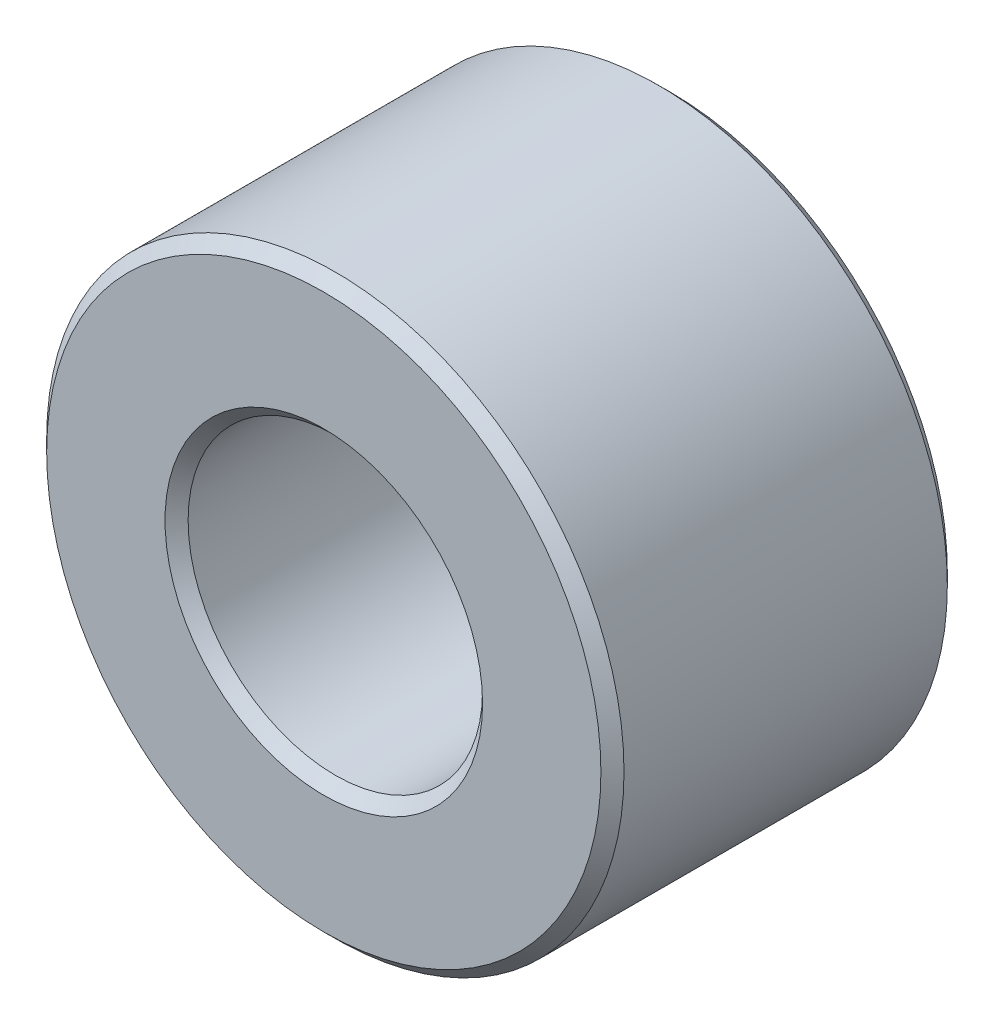
ISO-10303-21;
HEADER;
FILE_DESCRIPTION(('STEP AP214'),'2;1');
FILE_NAME('part.step','',(''),(''),'','','');
FILE_SCHEMA(('AUTOMOTIVE_DESIGN { 1 0 10303 214 1 1 1 1 }'));
ENDSEC;
DATA;
#1=APPLICATION_CONTEXT('core data for automotive mechanical design processes');
#2=APPLICATION_PROTOCOL_DEFINITION('international standard','automotive_design',2000,#1);
#3=PRODUCT_CONTEXT('',#1,'mechanical');
#4=PRODUCT('Part','Part','',(#3));
#5=PRODUCT_RELATED_PRODUCT_CATEGORY('part','',(#4));
#6=PRODUCT_DEFINITION_FORMATION('','',#4);
#7=PRODUCT_DEFINITION_CONTEXT('part definition',#1,'design');
#8=PRODUCT_DEFINITION('design','',#6,#7);
#9=PRODUCT_DEFINITION_SHAPE('','',#8);
#10=(LENGTH_UNIT() NAMED_UNIT(*) SI_UNIT(.MILLI.,.METRE.));
#11=(NAMED_UNIT(*) PLANE_ANGLE_UNIT() SI_UNIT($,.RADIAN.));
#12=(NAMED_UNIT(*) SI_UNIT($,.STERADIAN.) SOLID_ANGLE_UNIT());
#13=UNCERTAINTY_MEASURE_WITH_UNIT(LENGTH_MEASURE(1.E-05),#10,'distance_accuracy_value','');
#14=(GEOMETRIC_REPRESENTATION_CONTEXT(3) GLOBAL_UNCERTAINTY_ASSIGNED_CONTEXT((#13)) GLOBAL_UNIT_ASSIGNED_CONTEXT((#10,
#11,#12)) REPRESENTATION_CONTEXT('',''));
#15=CARTESIAN_POINT('',(0.,0.,0.));
#16=DIRECTION('',(0.,0.,1.));
#17=DIRECTION('',(1.,0.,0.));
#18=AXIS2_PLACEMENT_3D('',#15,#16,#17);
#19=CARTESIAN_POINT('',(0.,0.,6.));
#20=DIRECTION('',(0.,0.,1.));
#21=DIRECTION('',(1.,0.,0.));
#22=AXIS2_PLACEMENT_3D('',#19,#20,#21);
#23=PLANE('',#22);
#24=CARTESIAN_POINT('',(0.,0.,6.));
#25=DIRECTION('',(0.,0.,1.));
#26=DIRECTION('',(1.,0.,0.));
#27=AXIS2_PLACEMENT_3D('',#24,#25,#26);
#28=CIRCLE('',#27,2.75);
#29=CARTESIAN_POINT('',(2.75,0.,6.));
#30=VERTEX_POINT('',#29);
#31=EDGE_CURVE('E10',#30,#30,#28,.F.);
#32=ORIENTED_EDGE('',*,*,#31,.T.);
#33=EDGE_LOOP('',(#32));
#34=FACE_BOUND('',#33,.T.);
#35=CARTESIAN_POINT('',(0.,0.,6.));
#36=DIRECTION('',(0.,0.,1.));
#37=DIRECTION('',(1.,0.,0.));
#38=AXIS2_PLACEMENT_3D('',#35,#36,#37);
#39=CIRCLE('',#38,4.8);
#40=CARTESIAN_POINT('',(4.8,0.,6.));
#41=VERTEX_POINT('',#40);
#42=EDGE_CURVE('E39',#41,#41,#39,.T.);
#43=ORIENTED_EDGE('',*,*,#42,.T.);
#44=EDGE_LOOP('',(#43));
#45=FACE_BOUND('',#44,.T.);
#46=ADVANCED_FACE('F32',(#34,#45),#23,.T.);
#47=CARTESIAN_POINT('',(0.,0.,0.));
#48=DIRECTION('',(0.,0.,1.));
#49=DIRECTION('',(1.,0.,0.));
#50=AXIS2_PLACEMENT_3D('',#47,#48,#49);
#51=PLANE('',#50);
#52=CARTESIAN_POINT('',(0.,0.,0.));
#53=DIRECTION('',(0.,0.,1.));
#54=DIRECTION('',(1.,0.,0.));
#55=AXIS2_PLACEMENT_3D('',#52,#53,#54);
#56=CIRCLE('',#55,4.8);
#57=CARTESIAN_POINT('',(4.8,0.,0.));
#58=VERTEX_POINT('',#57);
#59=EDGE_CURVE('E52',#58,#58,#56,.F.);
#60=ORIENTED_EDGE('',*,*,#59,.T.);
#61=EDGE_LOOP('',(#60));
#62=FACE_BOUND('',#61,.T.);
#63=CARTESIAN_POINT('',(0.,0.,0.));
#64=DIRECTION('',(0.,0.,1.));
#65=DIRECTION('',(1.,0.,0.));
#66=AXIS2_PLACEMENT_3D('',#63,#64,#65);
#67=CIRCLE('',#66,2.75);
#68=CARTESIAN_POINT('',(2.75,0.,0.));
#69=VERTEX_POINT('',#68);
#70=EDGE_CURVE('E55',#69,#69,#67,.T.);
#71=ORIENTED_EDGE('',*,*,#70,.T.);
#72=EDGE_LOOP('',(#71));
#73=FACE_BOUND('',#72,.T.);
#74=ADVANCED_FACE('F76',(#62,#73),#51,.F.);
#75=CARTESIAN_POINT('',(0.,0.,6.));
#76=DIRECTION('',(0.,0.,-1.));
#77=DIRECTION('',(-1.,0.,0.));
#78=AXIS2_PLACEMENT_3D('',#75,#76,#77);
#79=CYLINDRICAL_SURFACE('',#78,5.);
#80=CARTESIAN_POINT('',(0.,0.,0.199999999999998));
#81=DIRECTION('',(0.,0.,1.));
#82=DIRECTION('',(1.,0.,0.));
#83=AXIS2_PLACEMENT_3D('',#80,#81,#82);
#84=CIRCLE('',#83,5.);
#85=CARTESIAN_POINT('',(5.,0.,0.199999999999998));
#86=VERTEX_POINT('',#85);
#87=EDGE_CURVE('E58',#86,#86,#84,.T.);
#88=ORIENTED_EDGE('',*,*,#87,.T.);
#89=EDGE_LOOP('',(#88));
#90=FACE_BOUND('',#89,.T.);
#91=CARTESIAN_POINT('',(0.,0.,5.8));
#92=DIRECTION('',(0.,0.,1.));
#93=DIRECTION('',(1.,0.,0.));
#94=AXIS2_PLACEMENT_3D('',#91,#92,#93);
#95=CIRCLE('',#94,5.);
#96=CARTESIAN_POINT('',(5.,0.,5.8));
#97=VERTEX_POINT('',#96);
#98=EDGE_CURVE('E61',#97,#97,#95,.F.);
#99=ORIENTED_EDGE('',*,*,#98,.T.);
#100=EDGE_LOOP('',(#99));
#101=FACE_BOUND('',#100,.T.);
#102=ADVANCED_FACE('F65',(#90,#101),#79,.T.);
#103=CARTESIAN_POINT('',(0.,0.,6.));
#104=DIRECTION('',(0.,0.,-1.));
#105=DIRECTION('',(-1.,0.,0.));
#106=AXIS2_PLACEMENT_3D('',#103,#104,#105);
#107=CYLINDRICAL_SURFACE('',#106,2.55);
#108=CARTESIAN_POINT('',(0.,0.,0.200000000000003));
#109=DIRECTION('',(0.,0.,1.));
#110=DIRECTION('',(1.,0.,0.));
#111=AXIS2_PLACEMENT_3D('',#108,#109,#110);
#112=CIRCLE('',#111,2.55);
#113=CARTESIAN_POINT('',(2.55,0.,0.200000000000003));
#114=VERTEX_POINT('',#113);
#115=EDGE_CURVE('E43',#114,#114,#112,.F.);
#116=ORIENTED_EDGE('',*,*,#115,.T.);
#117=EDGE_LOOP('',(#116));
#118=FACE_BOUND('',#117,.T.);
#119=CARTESIAN_POINT('',(0.,0.,5.8));
#120=DIRECTION('',(0.,0.,1.));
#121=DIRECTION('',(1.,0.,0.));
#122=AXIS2_PLACEMENT_3D('',#119,#120,#121);
#123=CIRCLE('',#122,2.55);
#124=CARTESIAN_POINT('',(2.55,0.,5.8));
#125=VERTEX_POINT('',#124);
#126=EDGE_CURVE('E47',#125,#125,#123,.T.);
#127=ORIENTED_EDGE('',*,*,#126,.T.);
#128=EDGE_LOOP('',(#127));
#129=FACE_BOUND('',#128,.T.);
#130=ADVANCED_FACE('F84',(#118,#129),#107,.F.);
#131=CARTESIAN_POINT('',(0.,0.,0.199999999999998));
#132=DIRECTION('',(0.,0.,1.));
#133=DIRECTION('',(1.,0.,0.));
#134=AXIS2_PLACEMENT_3D('',#131,#132,#133);
#135=CONICAL_SURFACE('',#134,5.,0.785398163397455);
#136=ORIENTED_EDGE('',*,*,#59,.F.);
#137=EDGE_LOOP('',(#136));
#138=FACE_BOUND('',#137,.T.);
#139=ORIENTED_EDGE('',*,*,#87,.F.);
#140=EDGE_LOOP('',(#139));
#141=FACE_BOUND('',#140,.T.);
#142=ADVANCED_FACE('F89',(#138,#141),#135,.T.);
#143=CARTESIAN_POINT('',(0.,0.,0.));
#144=DIRECTION('',(0.,0.,-1.));
#145=DIRECTION('',(-1.,0.,0.));
#146=AXIS2_PLACEMENT_3D('',#143,#144,#145);
#147=CONICAL_SURFACE('',#146,2.75,0.785398163397443);
#148=ORIENTED_EDGE('',*,*,#115,.F.);
#149=EDGE_LOOP('',(#148));
#150=FACE_BOUND('',#149,.T.);
#151=ORIENTED_EDGE('',*,*,#70,.F.);
#152=EDGE_LOOP('',(#151));
#153=FACE_BOUND('',#152,.T.);
#154=ADVANCED_FACE('F73',(#150,#153),#147,.F.);
#155=CARTESIAN_POINT('',(0.,0.,5.8));
#156=DIRECTION('',(0.,0.,1.));
#157=DIRECTION('',(1.,0.,0.));
#158=AXIS2_PLACEMENT_3D('',#155,#156,#157);
#159=CONICAL_SURFACE('',#158,2.55,0.785398163397454);
#160=ORIENTED_EDGE('',*,*,#31,.F.);
#161=EDGE_LOOP('',(#160));
#162=FACE_BOUND('',#161,.T.);
#163=ORIENTED_EDGE('',*,*,#126,.F.);
#164=EDGE_LOOP('',(#163));
#165=FACE_BOUND('',#164,.T.);
#166=ADVANCED_FACE('F69',(#162,#165),#159,.F.);
#167=CARTESIAN_POINT('',(0.,0.,6.));
#168=DIRECTION('',(0.,0.,-1.));
#169=DIRECTION('',(-1.,0.,0.));
#170=AXIS2_PLACEMENT_3D('',#167,#168,#169);
#171=CONICAL_SURFACE('',#170,4.8,0.785398163397448);
#172=ORIENTED_EDGE('',*,*,#98,.F.);
#173=EDGE_LOOP('',(#172));
#174=FACE_BOUND('',#173,.T.);
#175=ORIENTED_EDGE('',*,*,#42,.F.);
#176=EDGE_LOOP('',(#175));
#177=FACE_BOUND('',#176,.T.);
#178=ADVANCED_FACE('F34',(#174,#177),#171,.T.);
#179=CLOSED_SHELL('',(#46,#74,#102,#130,#142,#154,#166,#178));
#180=MANIFOLD_SOLID_BREP('B2',#179);
#181=ADVANCED_BREP_SHAPE_REPRESENTATION('',(#18,#180),#14);
#182=SHAPE_DEFINITION_REPRESENTATION(#9,#181);
ENDSEC;
END-ISO-10303-21;
